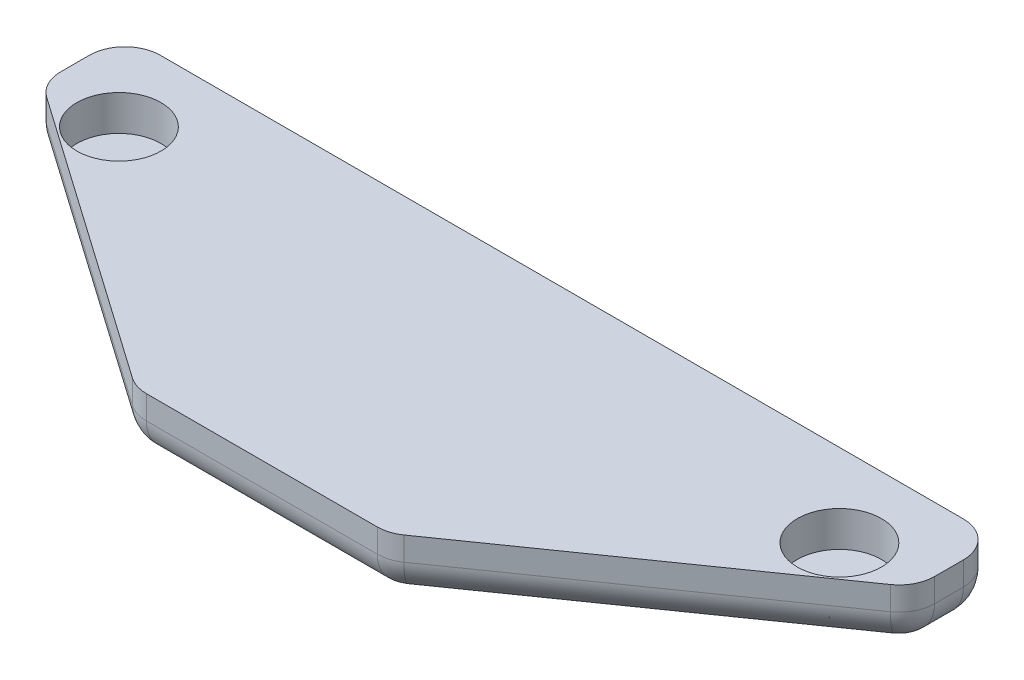
ISO-10303-21;
HEADER;
FILE_DESCRIPTION(('STEP AP214'),'2;1');
FILE_NAME('part.step','',(''),(''),'','','');
FILE_SCHEMA(('AUTOMOTIVE_DESIGN { 1 0 10303 214 1 1 1 1 }'));
ENDSEC;
DATA;
#1=APPLICATION_CONTEXT('core data for automotive mechanical design processes');
#2=APPLICATION_PROTOCOL_DEFINITION('international standard','automotive_design',2000,#1);
#3=PRODUCT_CONTEXT('',#1,'mechanical');
#4=PRODUCT('Part','Part','',(#3));
#5=PRODUCT_RELATED_PRODUCT_CATEGORY('part','',(#4));
#6=PRODUCT_DEFINITION_FORMATION('','',#4);
#7=PRODUCT_DEFINITION_CONTEXT('part definition',#1,'design');
#8=PRODUCT_DEFINITION('design','',#6,#7);
#9=PRODUCT_DEFINITION_SHAPE('','',#8);
#10=(LENGTH_UNIT() NAMED_UNIT(*) SI_UNIT(.MILLI.,.METRE.));
#11=(NAMED_UNIT(*) PLANE_ANGLE_UNIT() SI_UNIT($,.RADIAN.));
#12=(NAMED_UNIT(*) SI_UNIT($,.STERADIAN.) SOLID_ANGLE_UNIT());
#13=UNCERTAINTY_MEASURE_WITH_UNIT(LENGTH_MEASURE(1.E-05),#10,'distance_accuracy_value','');
#14=(GEOMETRIC_REPRESENTATION_CONTEXT(3) GLOBAL_UNCERTAINTY_ASSIGNED_CONTEXT((#13)) GLOBAL_UNIT_ASSIGNED_CONTEXT((#10,
#11,#12)) REPRESENTATION_CONTEXT('',''));
#15=CARTESIAN_POINT('',(0.,0.,0.));
#16=DIRECTION('',(0.,0.,1.));
#17=DIRECTION('',(1.,0.,0.));
#18=AXIS2_PLACEMENT_3D('',#15,#16,#17);
#19=CARTESIAN_POINT('',(-2.71615383625442,2.5,-11.7419034293701));
#20=DIRECTION('',(0.,0.,1.));
#21=DIRECTION('',(1.,0.,0.));
#22=AXIS2_PLACEMENT_3D('',#19,#20,#21);
#23=PLANE('',#22);
#24=DIRECTION('',(-1.,0.,0.));
#25=VECTOR('',#24,1.);
#26=CARTESIAN_POINT('',(-2.71615383625442,1.5,-11.7419034293701));
#27=LINE('',#26,#25);
#28=CARTESIAN_POINT('',(14.2838461637456,1.5,-11.7419034293701));
#29=VERTEX_POINT('',#28);
#30=CARTESIAN_POINT('',(-19.7161538362544,1.5,-11.7419034293701));
#31=VERTEX_POINT('',#30);
#32=EDGE_CURVE('E310',#29,#31,#27,.T.);
#33=ORIENTED_EDGE('',*,*,#32,.T.);
#34=DIRECTION('',(0.,-1.,0.));
#35=VECTOR('',#34,1.);
#36=CARTESIAN_POINT('',(-19.7161538362544,2.5,-11.7419034293701));
#37=LINE('',#36,#35);
#38=CARTESIAN_POINT('',(-19.7161538362544,2.5,-11.7419034293701));
#39=VERTEX_POINT('',#38);
#40=EDGE_CURVE('E313',#31,#39,#37,.F.);
#41=ORIENTED_EDGE('',*,*,#40,.T.);
#42=DIRECTION('',(-1.,0.,0.));
#43=VECTOR('',#42,1.);
#44=CARTESIAN_POINT('',(-2.71615383625442,2.5,-11.7419034293701));
#45=LINE('',#44,#43);
#46=CARTESIAN_POINT('',(14.2838461637456,2.5,-11.7419034293701));
#47=VERTEX_POINT('',#46);
#48=EDGE_CURVE('E265',#47,#39,#45,.T.);
#49=ORIENTED_EDGE('',*,*,#48,.F.);
#50=DIRECTION('',(0.,-1.,0.));
#51=VECTOR('',#50,1.);
#52=CARTESIAN_POINT('',(14.2838461637456,2.5,-11.7419034293701));
#53=LINE('',#52,#51);
#54=EDGE_CURVE('E214',#29,#47,#53,.F.);
#55=ORIENTED_EDGE('',*,*,#54,.F.);
#56=EDGE_LOOP('',(#33,#41,#49,#55));
#57=FACE_BOUND('',#56,.T.);
#58=ADVANCED_FACE('F44',(#57),#23,.F.);
#59=CARTESIAN_POINT('',(-21.2161538362544,2.5,-11.7419034293701));
#60=DIRECTION('',(1.,0.,0.));
#61=DIRECTION('',(0.,0.,-1.));
#62=AXIS2_PLACEMENT_3D('',#59,#60,#61);
#63=PLANE('',#62);
#64=DIRECTION('',(0.,0.,1.));
#65=VECTOR('',#64,1.);
#66=CARTESIAN_POINT('',(-21.2161538362544,1.5,-11.7419034293701));
#67=LINE('',#66,#65);
#68=CARTESIAN_POINT('',(-21.2161538362544,1.5,-10.2419034293701));
#69=VERTEX_POINT('',#68);
#70=CARTESIAN_POINT('',(-21.2161538362544,1.5,-9.02278939825636));
#71=VERTEX_POINT('',#70);
#72=EDGE_CURVE('E301',#69,#71,#67,.T.);
#73=ORIENTED_EDGE('',*,*,#72,.T.);
#74=DIRECTION('',(0.,-1.,0.));
#75=VECTOR('',#74,1.);
#76=CARTESIAN_POINT('',(-21.2161538362544,2.5,-9.02278939825636));
#77=LINE('',#76,#75);
#78=CARTESIAN_POINT('',(-21.2161538362544,2.5,-9.02278939825636));
#79=VERTEX_POINT('',#78);
#80=EDGE_CURVE('E307',#71,#79,#77,.F.);
#81=ORIENTED_EDGE('',*,*,#80,.T.);
#82=DIRECTION('',(0.,0.,1.));
#83=VECTOR('',#82,1.);
#84=CARTESIAN_POINT('',(-21.2161538362544,2.5,-11.7419034293701));
#85=LINE('',#84,#83);
#86=CARTESIAN_POINT('',(-21.2161538362544,2.5,-10.2419034293701));
#87=VERTEX_POINT('',#86);
#88=EDGE_CURVE('E273',#87,#79,#85,.T.);
#89=ORIENTED_EDGE('',*,*,#88,.F.);
#90=DIRECTION('',(0.,-1.,0.));
#91=VECTOR('',#90,1.);
#92=CARTESIAN_POINT('',(-21.2161538362544,2.5,-10.2419034293701));
#93=LINE('',#92,#91);
#94=EDGE_CURVE('E304',#87,#69,#93,.T.);
#95=ORIENTED_EDGE('',*,*,#94,.T.);
#96=EDGE_LOOP('',(#73,#81,#89,#95));
#97=FACE_BOUND('',#96,.T.);
#98=ADVANCED_FACE('F367',(#97),#63,.F.);
#99=CARTESIAN_POINT('',(-21.2161538362544,2.5,-8.24190342937014));
#100=DIRECTION('',(0.573546021853428,0.,-0.819173339908048));
#101=DIRECTION('',(-0.819173339908049,0.,-0.573546021853428));
#102=AXIS2_PLACEMENT_3D('',#99,#100,#101);
#103=PLANE('',#102);
#104=DIRECTION('',(0.819173339908049,0.,0.573546021853428));
#105=VECTOR('',#104,1.);
#106=CARTESIAN_POINT('',(-21.2161538362544,1.5,-8.24190342937014));
#107=LINE('',#106,#105);
#108=CARTESIAN_POINT('',(-20.5764728690346,1.5,-7.79402938839429));
#109=VERTEX_POINT('',#108);
#110=CARTESIAN_POINT('',(-8.46355530042968,1.5,0.686856580491928));
#111=VERTEX_POINT('',#110);
#112=EDGE_CURVE('E284',#109,#111,#107,.T.);
#113=ORIENTED_EDGE('',*,*,#112,.T.);
#114=DIRECTION('',(0.,-1.,0.));
#115=VECTOR('',#114,1.);
#116=CARTESIAN_POINT('',(-8.46355530042968,2.5,0.686856580491928));
#117=LINE('',#116,#115);
#118=CARTESIAN_POINT('',(-8.46355530042968,2.5,0.686856580491928));
#119=VERTEX_POINT('',#118);
#120=EDGE_CURVE('E290',#111,#119,#117,.F.);
#121=ORIENTED_EDGE('',*,*,#120,.T.);
#122=DIRECTION('',(0.819173339908048,0.,0.573546021853428));
#123=VECTOR('',#122,1.);
#124=CARTESIAN_POINT('',(-21.2161538362544,2.5,-8.24190342937014));
#125=LINE('',#124,#123);
#126=CARTESIAN_POINT('',(-20.5764728690346,2.5,-7.79402938839429));
#127=VERTEX_POINT('',#126);
#128=EDGE_CURVE('E164',#127,#119,#125,.T.);
#129=ORIENTED_EDGE('',*,*,#128,.F.);
#130=DIRECTION('',(0.,-1.,0.));
#131=VECTOR('',#130,1.);
#132=CARTESIAN_POINT('',(-20.5764728690346,2.5,-7.79402938839429));
#133=LINE('',#132,#131);
#134=EDGE_CURVE('E287',#127,#109,#133,.T.);
#135=ORIENTED_EDGE('',*,*,#134,.T.);
#136=EDGE_LOOP('',(#113,#121,#129,#135));
#137=FACE_BOUND('',#136,.T.);
#138=ADVANCED_FACE('F378',(#137),#103,.F.);
#139=CARTESIAN_POINT('',(-8.07615383625442,2.5,0.958096570629856));
#140=DIRECTION('',(0.,0.,-1.));
#141=DIRECTION('',(-1.,0.,0.));
#142=AXIS2_PLACEMENT_3D('',#139,#140,#141);
#143=PLANE('',#142);
#144=DIRECTION('',(1.,0.,0.));
#145=VECTOR('',#144,1.);
#146=CARTESIAN_POINT('',(-8.07615383625442,2.5,0.958096570629856));
#147=LINE('',#146,#145);
#148=CARTESIAN_POINT('',(-7.60323626764954,2.5,0.958096570629856));
#149=VERTEX_POINT('',#148);
#150=CARTESIAN_POINT('',(2.1709285951407,2.5,0.958096570629856));
#151=VERTEX_POINT('',#150);
#152=EDGE_CURVE('E148',#149,#151,#147,.T.);
#153=ORIENTED_EDGE('',*,*,#152,.F.);
#154=DIRECTION('',(0.,-1.,0.));
#155=VECTOR('',#154,1.);
#156=CARTESIAN_POINT('',(-7.60323626764954,2.5,0.958096570629856));
#157=LINE('',#156,#155);
#158=CARTESIAN_POINT('',(-7.60323626764954,1.5,0.958096570629856));
#159=VERTEX_POINT('',#158);
#160=EDGE_CURVE('E281',#149,#159,#157,.T.);
#161=ORIENTED_EDGE('',*,*,#160,.T.);
#162=DIRECTION('',(1.,0.,0.));
#163=VECTOR('',#162,1.);
#164=CARTESIAN_POINT('',(-8.07615383625442,1.5,0.958096570629856));
#165=LINE('',#164,#163);
#166=CARTESIAN_POINT('',(2.1709285951407,1.5,0.958096570629856));
#167=VERTEX_POINT('',#166);
#168=EDGE_CURVE('E163',#159,#167,#165,.T.);
#169=ORIENTED_EDGE('',*,*,#168,.T.);
#170=DIRECTION('',(0.,-1.,0.));
#171=VECTOR('',#170,1.);
#172=CARTESIAN_POINT('',(2.1709285951407,2.5,0.958096570629856));
#173=LINE('',#172,#171);
#174=EDGE_CURVE('E169',#151,#167,#173,.T.);
#175=ORIENTED_EDGE('',*,*,#174,.F.);
#176=EDGE_LOOP('',(#153,#161,#169,#175));
#177=FACE_BOUND('',#176,.T.);
#178=ADVANCED_FACE('F177',(#177),#143,.F.);
#179=CARTESIAN_POINT('',(0.,2.5,0.));
#180=DIRECTION('',(0.,1.,0.));
#181=DIRECTION('',(0.,0.,1.));
#182=AXIS2_PLACEMENT_3D('',#179,#180,#181);
#183=PLANE('',#182);
#184=CARTESIAN_POINT('',(-17.9661538362544,2.5,-8.24190342937015));
#185=DIRECTION('',(0.,1.,0.));
#186=DIRECTION('',(0.,0.,1.));
#187=AXIS2_PLACEMENT_3D('',#184,#185,#186);
#188=CIRCLE('',#187,1.78);
#189=CARTESIAN_POINT('',(-17.9661538362544,2.5,-6.46190342937015));
#190=VERTEX_POINT('',#189);
#191=EDGE_CURVE('E266',#190,#190,#188,.T.);
#192=ORIENTED_EDGE('',*,*,#191,.F.);
#193=EDGE_LOOP('',(#192));
#194=FACE_BOUND('',#193,.T.);
#195=ORIENTED_EDGE('',*,*,#128,.T.);
#196=CARTESIAN_POINT('',(-7.60323626764954,2.5,-0.541903429370144));
#197=DIRECTION('',(0.,1.,0.));
#198=DIRECTION('',(0.,0.,1.));
#199=AXIS2_PLACEMENT_3D('',#196,#197,#198);
#200=CIRCLE('',#199,1.5);
#201=EDGE_CURVE('E157',#119,#149,#200,.T.);
#202=ORIENTED_EDGE('',*,*,#201,.T.);
#203=ORIENTED_EDGE('',*,*,#152,.T.);
#204=CARTESIAN_POINT('',(2.1709285951407,2.5,-0.541903429370144));
#205=DIRECTION('',(0.,-1.,0.));
#206=DIRECTION('',(0.,0.,1.));
#207=AXIS2_PLACEMENT_3D('',#204,#205,#206);
#208=CIRCLE('',#207,1.5);
#209=CARTESIAN_POINT('',(3.03124762792084,2.5,0.686856580491928));
#210=VERTEX_POINT('',#209);
#211=EDGE_CURVE('E154',#210,#151,#208,.T.);
#212=ORIENTED_EDGE('',*,*,#211,.F.);
#213=DIRECTION('',(-0.819173339908048,0.,0.573546021853428));
#214=VECTOR('',#213,1.);
#215=CARTESIAN_POINT('',(15.7838461637456,2.5,-8.24190342937014));
#216=LINE('',#215,#214);
#217=CARTESIAN_POINT('',(15.1441651965257,2.5,-7.79402938839429));
#218=VERTEX_POINT('',#217);
#219=EDGE_CURVE('E182',#218,#210,#216,.T.);
#220=ORIENTED_EDGE('',*,*,#219,.F.);
#221=CARTESIAN_POINT('',(14.2838461637456,2.5,-9.02278939825636));
#222=DIRECTION('',(0.,-1.,0.));
#223=DIRECTION('',(0.,0.,1.));
#224=AXIS2_PLACEMENT_3D('',#221,#222,#223);
#225=CIRCLE('',#224,1.5);
#226=CARTESIAN_POINT('',(15.7838461637456,2.5,-9.02278939825636));
#227=VERTEX_POINT('',#226);
#228=EDGE_CURVE('E175',#227,#218,#225,.T.);
#229=ORIENTED_EDGE('',*,*,#228,.F.);
#230=DIRECTION('',(0.,0.,1.));
#231=VECTOR('',#230,1.);
#232=CARTESIAN_POINT('',(15.7838461637456,2.5,-11.7419034293701));
#233=LINE('',#232,#231);
#234=CARTESIAN_POINT('',(15.7838461637456,2.5,-10.2419034293701));
#235=VERTEX_POINT('',#234);
#236=EDGE_CURVE('E189',#235,#227,#233,.T.);
#237=ORIENTED_EDGE('',*,*,#236,.F.);
#238=CARTESIAN_POINT('',(14.2838461637456,2.5,-10.2419034293701));
#239=DIRECTION('',(0.,-1.,0.));
#240=DIRECTION('',(0.,0.,1.));
#241=AXIS2_PLACEMENT_3D('',#238,#239,#240);
#242=CIRCLE('',#241,1.5);
#243=EDGE_CURVE('E198',#47,#235,#242,.T.);
#244=ORIENTED_EDGE('',*,*,#243,.F.);
#245=ORIENTED_EDGE('',*,*,#48,.T.);
#246=CARTESIAN_POINT('',(-19.7161538362544,2.5,-10.2419034293701));
#247=DIRECTION('',(0.,1.,0.));
#248=DIRECTION('',(0.,0.,1.));
#249=AXIS2_PLACEMENT_3D('',#246,#247,#248);
#250=CIRCLE('',#249,1.5);
#251=EDGE_CURVE('E293',#39,#87,#250,.T.);
#252=ORIENTED_EDGE('',*,*,#251,.T.);
#253=ORIENTED_EDGE('',*,*,#88,.T.);
#254=CARTESIAN_POINT('',(-19.7161538362544,2.5,-9.02278939825636));
#255=DIRECTION('',(0.,1.,0.));
#256=DIRECTION('',(0.,0.,1.));
#257=AXIS2_PLACEMENT_3D('',#254,#255,#256);
#258=CIRCLE('',#257,1.5);
#259=EDGE_CURVE('E296',#79,#127,#258,.T.);
#260=ORIENTED_EDGE('',*,*,#259,.T.);
#261=EDGE_LOOP('',(#195,#202,#203,#212,#220,#229,#237,#244,#245,#252,#253,#260));
#262=FACE_BOUND('',#261,.T.);
#263=CARTESIAN_POINT('',(12.5338461637456,2.5,-8.24190342937015));
#264=DIRECTION('',(0.,-1.,0.));
#265=DIRECTION('',(0.,0.,1.));
#266=AXIS2_PLACEMENT_3D('',#263,#264,#265);
#267=CIRCLE('',#266,1.78);
#268=CARTESIAN_POINT('',(12.5338461637456,2.5,-6.46190342937015));
#269=VERTEX_POINT('',#268);
#270=EDGE_CURVE('E260',#269,#269,#267,.T.);
#271=ORIENTED_EDGE('',*,*,#270,.T.);
#272=EDGE_LOOP('',(#271));
#273=FACE_BOUND('',#272,.T.);
#274=ADVANCED_FACE('F151',(#194,#262,#273),#183,.T.);
#275=CARTESIAN_POINT('',(0.,0.,0.));
#276=DIRECTION('',(0.,1.,0.));
#277=DIRECTION('',(0.,0.,1.));
#278=AXIS2_PLACEMENT_3D('',#275,#276,#277);
#279=PLANE('',#278);
#280=DIRECTION('',(-1.,0.,0.));
#281=VECTOR('',#280,1.);
#282=CARTESIAN_POINT('',(0.,0.,-10.2419034293701));
#283=LINE('',#282,#281);
#284=CARTESIAN_POINT('',(-19.7161538362544,0.,-10.2419034293701));
#285=VERTEX_POINT('',#284);
#286=CARTESIAN_POINT('',(14.2838461637456,0.,-10.2419034293701));
#287=VERTEX_POINT('',#286);
#288=EDGE_CURVE('E316',#285,#287,#283,.F.);
#289=ORIENTED_EDGE('',*,*,#288,.T.);
#290=DIRECTION('',(0.,0.,1.));
#291=VECTOR('',#290,1.);
#292=CARTESIAN_POINT('',(14.2838461637456,0.,0.));
#293=LINE('',#292,#291);
#294=CARTESIAN_POINT('',(14.2838461637456,0.,-9.02278939825636));
#295=VERTEX_POINT('',#294);
#296=EDGE_CURVE('E218',#295,#287,#293,.F.);
#297=ORIENTED_EDGE('',*,*,#296,.F.);
#298=DIRECTION('',(-0.819173339908049,0.,0.573546021853428));
#299=VECTOR('',#298,1.);
#300=CARTESIAN_POINT('',(-3.18578923282157,0.,3.20861438016204));
#301=LINE('',#300,#299);
#302=CARTESIAN_POINT('',(2.1709285951407,0.,-0.541903429370144));
#303=VERTEX_POINT('',#302);
#304=EDGE_CURVE('E222',#303,#295,#301,.F.);
#305=ORIENTED_EDGE('',*,*,#304,.F.);
#306=DIRECTION('',(1.,0.,0.));
#307=VECTOR('',#306,1.);
#308=CARTESIAN_POINT('',(0.,0.,-0.541903429370144));
#309=LINE('',#308,#307);
#310=CARTESIAN_POINT('',(-7.60323626764954,0.,-0.541903429370144));
#311=VERTEX_POINT('',#310);
#312=EDGE_CURVE('E11',#303,#311,#309,.F.);
#313=ORIENTED_EDGE('',*,*,#312,.T.);
#314=DIRECTION('',(0.819173339908049,0.,0.573546021853428));
#315=VECTOR('',#314,1.);
#316=CARTESIAN_POINT('',(-2.24651843968727,0.,3.20861438016204));
#317=LINE('',#316,#315);
#318=CARTESIAN_POINT('',(-19.7161538362544,0.,-9.02278939825636));
#319=VERTEX_POINT('',#318);
#320=EDGE_CURVE('E54',#311,#319,#317,.F.);
#321=ORIENTED_EDGE('',*,*,#320,.T.);
#322=DIRECTION('',(0.,0.,1.));
#323=VECTOR('',#322,1.);
#324=CARTESIAN_POINT('',(-19.7161538362544,0.,0.));
#325=LINE('',#324,#323);
#326=EDGE_CURVE('E319',#319,#285,#325,.F.);
#327=ORIENTED_EDGE('',*,*,#326,.T.);
#328=EDGE_LOOP('',(#289,#297,#305,#313,#321,#327));
#329=FACE_BOUND('',#328,.T.);
#330=ADVANCED_FACE('F395',(#329),#279,.F.);
#331=CARTESIAN_POINT('',(-17.9661538362544,1.,-8.24190342937015));
#332=DIRECTION('',(0.,1.,0.));
#333=DIRECTION('',(0.,0.,1.));
#334=AXIS2_PLACEMENT_3D('',#331,#332,#333);
#335=CYLINDRICAL_SURFACE('',#334,1.78);
#336=CARTESIAN_POINT('',(-17.9661538362544,1.,-8.24190342937015));
#337=DIRECTION('',(0.,1.,0.));
#338=DIRECTION('',(0.,0.,1.));
#339=AXIS2_PLACEMENT_3D('',#336,#337,#338);
#340=CIRCLE('',#339,1.78);
#341=CARTESIAN_POINT('',(-17.9661538362544,1.,-6.46190342937015));
#342=VERTEX_POINT('',#341);
#343=EDGE_CURVE('E261',#342,#342,#340,.T.);
#344=ORIENTED_EDGE('',*,*,#343,.F.);
#345=EDGE_LOOP('',(#344));
#346=FACE_BOUND('',#345,.T.);
#347=ORIENTED_EDGE('',*,*,#191,.T.);
#348=EDGE_LOOP('',(#347));
#349=FACE_BOUND('',#348,.T.);
#350=ADVANCED_FACE('F502',(#346,#349),#335,.F.);
#351=CARTESIAN_POINT('',(-17.9661538362544,1.,-8.24190342937015));
#352=DIRECTION('',(0.,1.,0.));
#353=DIRECTION('',(0.,0.,1.));
#354=AXIS2_PLACEMENT_3D('',#351,#352,#353);
#355=PLANE('',#354);
#356=ORIENTED_EDGE('',*,*,#343,.T.);
#357=EDGE_LOOP('',(#356));
#358=FACE_BOUND('',#357,.T.);
#359=ADVANCED_FACE('F471',(#358),#355,.T.);
#360=CARTESIAN_POINT('',(-2.71615383625442,1.5,-10.2419034293701));
#361=DIRECTION('',(-1.,0.,0.));
#362=DIRECTION('',(0.,0.,1.));
#363=AXIS2_PLACEMENT_3D('',#360,#361,#362);
#364=CYLINDRICAL_SURFACE('',#363,1.5);
#365=ORIENTED_EDGE('',*,*,#32,.F.);
#366=CARTESIAN_POINT('',(14.2838461637456,1.5,-10.2419034293701));
#367=DIRECTION('',(-1.,0.,0.));
#368=DIRECTION('',(0.,0.,1.));
#369=AXIS2_PLACEMENT_3D('',#366,#367,#368);
#370=CIRCLE('',#369,1.5);
#371=EDGE_CURVE('E256',#29,#287,#370,.T.);
#372=ORIENTED_EDGE('',*,*,#371,.T.);
#373=ORIENTED_EDGE('',*,*,#288,.F.);
#374=CARTESIAN_POINT('',(-19.7161538362544,1.5,-10.2419034293701));
#375=DIRECTION('',(-1.,0.,0.));
#376=DIRECTION('',(0.,0.,1.));
#377=AXIS2_PLACEMENT_3D('',#374,#375,#376);
#378=CIRCLE('',#377,1.5);
#379=EDGE_CURVE('E48',#31,#285,#378,.T.);
#380=ORIENTED_EDGE('',*,*,#379,.F.);
#381=EDGE_LOOP('',(#365,#372,#373,#380));
#382=FACE_BOUND('',#381,.T.);
#383=ADVANCED_FACE('F46',(#382),#364,.T.);
#384=CARTESIAN_POINT('',(-19.7161538362544,2.5,-10.2419034293701));
#385=DIRECTION('',(0.,-1.,0.));
#386=DIRECTION('',(0.,0.,-1.));
#387=AXIS2_PLACEMENT_3D('',#384,#385,#386);
#388=CYLINDRICAL_SURFACE('',#387,1.5);
#389=ORIENTED_EDGE('',*,*,#251,.F.);
#390=ORIENTED_EDGE('',*,*,#40,.F.);
#391=CARTESIAN_POINT('',(-19.7161538362544,1.5,-10.2419034293701));
#392=DIRECTION('',(0.,-1.,0.));
#393=DIRECTION('',(0.,0.,-1.));
#394=AXIS2_PLACEMENT_3D('',#391,#392,#393);
#395=CIRCLE('',#394,1.5);
#396=EDGE_CURVE('E349',#69,#31,#395,.T.);
#397=ORIENTED_EDGE('',*,*,#396,.F.);
#398=ORIENTED_EDGE('',*,*,#94,.F.);
#399=EDGE_LOOP('',(#389,#390,#397,#398));
#400=FACE_BOUND('',#399,.T.);
#401=ADVANCED_FACE('F465',(#400),#388,.T.);
#402=CARTESIAN_POINT('',(-19.7161538362544,1.5,-10.2419034293701));
#403=DIRECTION('',(0.,0.,-1.));
#404=DIRECTION('',(-1.,0.,0.));
#405=AXIS2_PLACEMENT_3D('',#402,#403,#404);
#406=SPHERICAL_SURFACE('',#405,1.5);
#407=ORIENTED_EDGE('',*,*,#396,.T.);
#408=ORIENTED_EDGE('',*,*,#379,.T.);
#409=CARTESIAN_POINT('',(-19.7161538362544,1.5,-10.2419034293701));
#410=DIRECTION('',(0.,0.,-1.));
#411=DIRECTION('',(-1.,0.,0.));
#412=AXIS2_PLACEMENT_3D('',#409,#410,#411);
#413=CIRCLE('',#412,1.5);
#414=EDGE_CURVE('E346',#69,#285,#413,.F.);
#415=ORIENTED_EDGE('',*,*,#414,.F.);
#416=EDGE_LOOP('',(#407,#408,#415));
#417=FACE_BOUND('',#416,.T.);
#418=ADVANCED_FACE('F358',(#417),#406,.T.);
#419=CARTESIAN_POINT('',(-19.7161538362544,1.5,-11.7419034293701));
#420=DIRECTION('',(0.,0.,1.));
#421=DIRECTION('',(1.,0.,0.));
#422=AXIS2_PLACEMENT_3D('',#419,#420,#421);
#423=CYLINDRICAL_SURFACE('',#422,1.5);
#424=ORIENTED_EDGE('',*,*,#414,.T.);
#425=ORIENTED_EDGE('',*,*,#326,.F.);
#426=CARTESIAN_POINT('',(-19.7161538362544,1.5,-9.02278939825636));
#427=DIRECTION('',(0.,0.,1.));
#428=DIRECTION('',(1.,0.,0.));
#429=AXIS2_PLACEMENT_3D('',#426,#427,#428);
#430=CIRCLE('',#429,1.5);
#431=EDGE_CURVE('E342',#71,#319,#430,.T.);
#432=ORIENTED_EDGE('',*,*,#431,.F.);
#433=ORIENTED_EDGE('',*,*,#72,.F.);
#434=EDGE_LOOP('',(#424,#425,#432,#433));
#435=FACE_BOUND('',#434,.T.);
#436=ADVANCED_FACE('F363',(#435),#423,.T.);
#437=CARTESIAN_POINT('',(-19.7161538362544,2.5,-9.02278939825636));
#438=DIRECTION('',(0.,-1.,0.));
#439=DIRECTION('',(0.,0.,-1.));
#440=AXIS2_PLACEMENT_3D('',#437,#438,#439);
#441=CYLINDRICAL_SURFACE('',#440,1.5);
#442=ORIENTED_EDGE('',*,*,#259,.F.);
#443=ORIENTED_EDGE('',*,*,#80,.F.);
#444=CARTESIAN_POINT('',(-19.7161538362544,1.5,-9.02278939825636));
#445=DIRECTION('',(0.,-1.,0.));
#446=DIRECTION('',(0.,0.,-1.));
#447=AXIS2_PLACEMENT_3D('',#444,#445,#446);
#448=CIRCLE('',#447,1.5);
#449=EDGE_CURVE('E338',#109,#71,#448,.T.);
#450=ORIENTED_EDGE('',*,*,#449,.F.);
#451=ORIENTED_EDGE('',*,*,#134,.F.);
#452=EDGE_LOOP('',(#442,#443,#450,#451));
#453=FACE_BOUND('',#452,.T.);
#454=ADVANCED_FACE('F373',(#453),#441,.T.);
#455=CARTESIAN_POINT('',(-19.7161538362544,1.5,-9.02278939825636));
#456=DIRECTION('',(0.,-1.,0.));
#457=DIRECTION('',(0.,0.,-1.));
#458=AXIS2_PLACEMENT_3D('',#455,#456,#457);
#459=SPHERICAL_SURFACE('',#458,1.5);
#460=ORIENTED_EDGE('',*,*,#449,.T.);
#461=ORIENTED_EDGE('',*,*,#431,.T.);
#462=CARTESIAN_POINT('',(-19.7161538362544,1.5,-9.02278939825636));
#463=DIRECTION('',(-0.819173339908048,0.,-0.573546021853428));
#464=DIRECTION('',(-0.573546021853428,0.,0.819173339908048));
#465=AXIS2_PLACEMENT_3D('',#462,#463,#464);
#466=CIRCLE('',#465,1.5);
#467=EDGE_CURVE('E334',#109,#319,#466,.F.);
#468=ORIENTED_EDGE('',*,*,#467,.F.);
#469=EDGE_LOOP('',(#460,#461,#468));
#470=FACE_BOUND('',#469,.T.);
#471=ADVANCED_FACE('F456',(#470),#459,.T.);
#472=CARTESIAN_POINT('',(-8.07615383625442,1.5,-0.541903429370144));
#473=DIRECTION('',(1.,0.,0.));
#474=DIRECTION('',(0.,0.,-1.));
#475=AXIS2_PLACEMENT_3D('',#472,#473,#474);
#476=CYLINDRICAL_SURFACE('',#475,1.5);
#477=ORIENTED_EDGE('',*,*,#312,.F.);
#478=CARTESIAN_POINT('',(2.1709285951407,1.5,-0.541903429370144));
#479=DIRECTION('',(-1.,0.,0.));
#480=DIRECTION('',(0.,0.,1.));
#481=AXIS2_PLACEMENT_3D('',#478,#479,#480);
#482=CIRCLE('',#481,1.5);
#483=EDGE_CURVE('E234',#303,#167,#482,.T.);
#484=ORIENTED_EDGE('',*,*,#483,.T.);
#485=ORIENTED_EDGE('',*,*,#168,.F.);
#486=CARTESIAN_POINT('',(-7.60323626764954,1.5,-0.541903429370144));
#487=DIRECTION('',(-1.,0.,0.));
#488=DIRECTION('',(0.,0.,1.));
#489=AXIS2_PLACEMENT_3D('',#486,#487,#488);
#490=CIRCLE('',#489,1.5);
#491=EDGE_CURVE('E330',#311,#159,#490,.T.);
#492=ORIENTED_EDGE('',*,*,#491,.F.);
#493=EDGE_LOOP('',(#477,#484,#485,#492));
#494=FACE_BOUND('',#493,.T.);
#495=ADVANCED_FACE('F389',(#494),#476,.T.);
#496=CARTESIAN_POINT('',(-20.3558348034743,1.5,-9.47066343923222));
#497=DIRECTION('',(0.819173339908049,0.,0.573546021853428));
#498=DIRECTION('',(0.573546021853428,0.,-0.819173339908048));
#499=AXIS2_PLACEMENT_3D('',#496,#497,#498);
#500=CYLINDRICAL_SURFACE('',#499,1.5);
#501=ORIENTED_EDGE('',*,*,#467,.T.);
#502=ORIENTED_EDGE('',*,*,#320,.F.);
#503=CARTESIAN_POINT('',(-7.60323626764954,1.5,-0.541903429370145));
#504=DIRECTION('',(0.819173339908048,0.,0.573546021853428));
#505=DIRECTION('',(0.573546021853428,0.,-0.819173339908049));
#506=AXIS2_PLACEMENT_3D('',#503,#504,#505);
#507=CIRCLE('',#506,1.5);
#508=EDGE_CURVE('E326',#111,#311,#507,.T.);
#509=ORIENTED_EDGE('',*,*,#508,.F.);
#510=ORIENTED_EDGE('',*,*,#112,.F.);
#511=EDGE_LOOP('',(#501,#502,#509,#510));
#512=FACE_BOUND('',#511,.T.);
#513=ADVANCED_FACE('F450',(#512),#500,.T.);
#514=CARTESIAN_POINT('',(-7.60323626764954,1.5,-0.541903429370144));
#515=DIRECTION('',(0.,-1.,0.));
#516=DIRECTION('',(1.,0.,0.));
#517=AXIS2_PLACEMENT_3D('',#514,#515,#516);
#518=SPHERICAL_SURFACE('',#517,1.5);
#519=ORIENTED_EDGE('',*,*,#508,.T.);
#520=ORIENTED_EDGE('',*,*,#491,.T.);
#521=CARTESIAN_POINT('',(-7.60323626764954,1.5,-0.541903429370144));
#522=DIRECTION('',(0.,-1.,0.));
#523=DIRECTION('',(0.,0.,-1.));
#524=AXIS2_PLACEMENT_3D('',#521,#522,#523);
#525=CIRCLE('',#524,1.5);
#526=EDGE_CURVE('E226',#111,#159,#525,.F.);
#527=ORIENTED_EDGE('',*,*,#526,.F.);
#528=EDGE_LOOP('',(#519,#520,#527));
#529=FACE_BOUND('',#528,.T.);
#530=ADVANCED_FACE('F386',(#529),#518,.T.);
#531=CARTESIAN_POINT('',(-7.60323626764954,2.5,-0.541903429370144));
#532=DIRECTION('',(0.,-1.,0.));
#533=DIRECTION('',(0.,0.,-1.));
#534=AXIS2_PLACEMENT_3D('',#531,#532,#533);
#535=CYLINDRICAL_SURFACE('',#534,1.5);
#536=ORIENTED_EDGE('',*,*,#201,.F.);
#537=ORIENTED_EDGE('',*,*,#120,.F.);
#538=ORIENTED_EDGE('',*,*,#526,.T.);
#539=ORIENTED_EDGE('',*,*,#160,.F.);
#540=EDGE_LOOP('',(#536,#537,#538,#539));
#541=FACE_BOUND('',#540,.T.);
#542=ADVANCED_FACE('F384',(#541),#535,.T.);
#543=CARTESIAN_POINT('',(15.7838461637456,2.5,-11.7419034293701));
#544=DIRECTION('',(-1.,0.,0.));
#545=DIRECTION('',(0.,0.,-1.));
#546=AXIS2_PLACEMENT_3D('',#543,#544,#545);
#547=PLANE('',#546);
#548=DIRECTION('',(0.,0.,1.));
#549=VECTOR('',#548,1.);
#550=CARTESIAN_POINT('',(15.7838461637456,1.5,-11.7419034293701));
#551=LINE('',#550,#549);
#552=CARTESIAN_POINT('',(15.7838461637456,1.5,-10.2419034293701));
#553=VERTEX_POINT('',#552);
#554=CARTESIAN_POINT('',(15.7838461637456,1.5,-9.02278939825636));
#555=VERTEX_POINT('',#554);
#556=EDGE_CURVE('E174',#553,#555,#551,.T.);
#557=ORIENTED_EDGE('',*,*,#556,.F.);
#558=DIRECTION('',(0.,-1.,0.));
#559=VECTOR('',#558,1.);
#560=CARTESIAN_POINT('',(15.7838461637456,2.5,-10.2419034293701));
#561=LINE('',#560,#559);
#562=EDGE_CURVE('E206',#235,#553,#561,.T.);
#563=ORIENTED_EDGE('',*,*,#562,.F.);
#564=ORIENTED_EDGE('',*,*,#236,.T.);
#565=DIRECTION('',(0.,-1.,0.));
#566=VECTOR('',#565,1.);
#567=CARTESIAN_POINT('',(15.7838461637456,2.5,-9.02278939825636));
#568=LINE('',#567,#566);
#569=EDGE_CURVE('E210',#555,#227,#568,.F.);
#570=ORIENTED_EDGE('',*,*,#569,.F.);
#571=EDGE_LOOP('',(#557,#563,#564,#570));
#572=FACE_BOUND('',#571,.T.);
#573=ADVANCED_FACE('F413',(#572),#547,.F.);
#574=CARTESIAN_POINT('',(15.7838461637456,2.5,-8.24190342937014));
#575=DIRECTION('',(-0.573546021853428,0.,-0.819173339908048));
#576=DIRECTION('',(0.819173339908049,0.,-0.573546021853428));
#577=AXIS2_PLACEMENT_3D('',#574,#575,#576);
#578=PLANE('',#577);
#579=DIRECTION('',(-0.819173339908049,0.,0.573546021853428));
#580=VECTOR('',#579,1.);
#581=CARTESIAN_POINT('',(15.7838461637456,1.5,-8.24190342937014));
#582=LINE('',#581,#580);
#583=CARTESIAN_POINT('',(15.1441651965257,1.5,-7.79402938839429));
#584=VERTEX_POINT('',#583);
#585=CARTESIAN_POINT('',(3.03124762792084,1.5,0.686856580491928));
#586=VERTEX_POINT('',#585);
#587=EDGE_CURVE('E181',#584,#586,#582,.T.);
#588=ORIENTED_EDGE('',*,*,#587,.F.);
#589=DIRECTION('',(0.,-1.,0.));
#590=VECTOR('',#589,1.);
#591=CARTESIAN_POINT('',(15.1441651965257,2.5,-7.79402938839429));
#592=LINE('',#591,#590);
#593=EDGE_CURVE('E187',#218,#584,#592,.T.);
#594=ORIENTED_EDGE('',*,*,#593,.F.);
#595=ORIENTED_EDGE('',*,*,#219,.T.);
#596=DIRECTION('',(0.,-1.,0.));
#597=VECTOR('',#596,1.);
#598=CARTESIAN_POINT('',(3.03124762792084,2.5,0.686856580491928));
#599=LINE('',#598,#597);
#600=EDGE_CURVE('E171',#586,#210,#599,.F.);
#601=ORIENTED_EDGE('',*,*,#600,.F.);
#602=EDGE_LOOP('',(#588,#594,#595,#601));
#603=FACE_BOUND('',#602,.T.);
#604=ADVANCED_FACE('F402',(#603),#578,.F.);
#605=CARTESIAN_POINT('',(12.5338461637456,1.,-8.24190342937015));
#606=DIRECTION('',(0.,1.,0.));
#607=DIRECTION('',(0.,0.,1.));
#608=AXIS2_PLACEMENT_3D('',#605,#606,#607);
#609=CYLINDRICAL_SURFACE('',#608,1.78);
#610=CARTESIAN_POINT('',(12.5338461637456,1.,-8.24190342937015));
#611=DIRECTION('',(0.,-1.,0.));
#612=DIRECTION('',(0.,0.,1.));
#613=AXIS2_PLACEMENT_3D('',#610,#611,#612);
#614=CIRCLE('',#613,1.78);
#615=CARTESIAN_POINT('',(12.5338461637456,1.,-6.46190342937015));
#616=VERTEX_POINT('',#615);
#617=EDGE_CURVE('E415',#616,#616,#614,.T.);
#618=ORIENTED_EDGE('',*,*,#617,.T.);
#619=EDGE_LOOP('',(#618));
#620=FACE_BOUND('',#619,.T.);
#621=ORIENTED_EDGE('',*,*,#270,.F.);
#622=EDGE_LOOP('',(#621));
#623=FACE_BOUND('',#622,.T.);
#624=ADVANCED_FACE('F424',(#620,#623),#609,.F.);
#625=CARTESIAN_POINT('',(12.5338461637456,1.,-8.24190342937015));
#626=DIRECTION('',(0.,1.,0.));
#627=DIRECTION('',(0.,0.,1.));
#628=AXIS2_PLACEMENT_3D('',#625,#626,#627);
#629=PLANE('',#628);
#630=ORIENTED_EDGE('',*,*,#617,.F.);
#631=EDGE_LOOP('',(#630));
#632=FACE_BOUND('',#631,.T.);
#633=ADVANCED_FACE('F426',(#632),#629,.T.);
#634=CARTESIAN_POINT('',(14.2838461637456,2.5,-10.2419034293701));
#635=DIRECTION('',(0.,-1.,0.));
#636=DIRECTION('',(0.,0.,-1.));
#637=AXIS2_PLACEMENT_3D('',#634,#635,#636);
#638=CYLINDRICAL_SURFACE('',#637,1.5);
#639=ORIENTED_EDGE('',*,*,#243,.T.);
#640=ORIENTED_EDGE('',*,*,#562,.T.);
#641=CARTESIAN_POINT('',(14.2838461637456,1.5,-10.2419034293701));
#642=DIRECTION('',(0.,1.,0.));
#643=DIRECTION('',(0.,0.,-1.));
#644=AXIS2_PLACEMENT_3D('',#641,#642,#643);
#645=CIRCLE('',#644,1.5);
#646=EDGE_CURVE('E252',#553,#29,#645,.T.);
#647=ORIENTED_EDGE('',*,*,#646,.T.);
#648=ORIENTED_EDGE('',*,*,#54,.T.);
#649=EDGE_LOOP('',(#639,#640,#647,#648));
#650=FACE_BOUND('',#649,.T.);
#651=ADVANCED_FACE('F433',(#650),#638,.T.);
#652=CARTESIAN_POINT('',(14.2838461637456,1.5,-10.2419034293701));
#653=DIRECTION('',(0.,0.,-1.));
#654=DIRECTION('',(1.,0.,0.));
#655=AXIS2_PLACEMENT_3D('',#652,#653,#654);
#656=SPHERICAL_SURFACE('',#655,1.5);
#657=ORIENTED_EDGE('',*,*,#646,.F.);
#658=CARTESIAN_POINT('',(14.2838461637456,1.5,-10.2419034293701));
#659=DIRECTION('',(0.,0.,1.));
#660=DIRECTION('',(1.,0.,0.));
#661=AXIS2_PLACEMENT_3D('',#658,#659,#660);
#662=CIRCLE('',#661,1.5);
#663=EDGE_CURVE('E248',#553,#287,#662,.F.);
#664=ORIENTED_EDGE('',*,*,#663,.T.);
#665=ORIENTED_EDGE('',*,*,#371,.F.);
#666=EDGE_LOOP('',(#657,#664,#665));
#667=FACE_BOUND('',#666,.T.);
#668=ADVANCED_FACE('F479',(#667),#656,.T.);
#669=CARTESIAN_POINT('',(14.2838461637456,1.5,-11.7419034293701));
#670=DIRECTION('',(0.,0.,1.));
#671=DIRECTION('',(-1.,0.,0.));
#672=AXIS2_PLACEMENT_3D('',#669,#670,#671);
#673=CYLINDRICAL_SURFACE('',#672,1.5);
#674=ORIENTED_EDGE('',*,*,#663,.F.);
#675=ORIENTED_EDGE('',*,*,#556,.T.);
#676=CARTESIAN_POINT('',(14.2838461637456,1.5,-9.02278939825636));
#677=DIRECTION('',(0.,0.,-1.));
#678=DIRECTION('',(-1.,0.,0.));
#679=AXIS2_PLACEMENT_3D('',#676,#677,#678);
#680=CIRCLE('',#679,1.5);
#681=EDGE_CURVE('E244',#555,#295,#680,.T.);
#682=ORIENTED_EDGE('',*,*,#681,.T.);
#683=ORIENTED_EDGE('',*,*,#296,.T.);
#684=EDGE_LOOP('',(#674,#675,#682,#683));
#685=FACE_BOUND('',#684,.T.);
#686=ADVANCED_FACE('F481',(#685),#673,.T.);
#687=CARTESIAN_POINT('',(14.2838461637456,2.5,-9.02278939825636));
#688=DIRECTION('',(0.,-1.,0.));
#689=DIRECTION('',(0.,0.,-1.));
#690=AXIS2_PLACEMENT_3D('',#687,#688,#689);
#691=CYLINDRICAL_SURFACE('',#690,1.5);
#692=ORIENTED_EDGE('',*,*,#228,.T.);
#693=ORIENTED_EDGE('',*,*,#593,.T.);
#694=CARTESIAN_POINT('',(14.2838461637456,1.5,-9.02278939825636));
#695=DIRECTION('',(0.,1.,0.));
#696=DIRECTION('',(0.,0.,-1.));
#697=AXIS2_PLACEMENT_3D('',#694,#695,#696);
#698=CIRCLE('',#697,1.5);
#699=EDGE_CURVE('E241',#584,#555,#698,.T.);
#700=ORIENTED_EDGE('',*,*,#699,.T.);
#701=ORIENTED_EDGE('',*,*,#569,.T.);
#702=EDGE_LOOP('',(#692,#693,#700,#701));
#703=FACE_BOUND('',#702,.T.);
#704=ADVANCED_FACE('F409',(#703),#691,.T.);
#705=CARTESIAN_POINT('',(14.2838461637456,1.5,-9.02278939825636));
#706=DIRECTION('',(0.,-1.,0.));
#707=DIRECTION('',(0.,0.,-1.));
#708=AXIS2_PLACEMENT_3D('',#705,#706,#707);
#709=SPHERICAL_SURFACE('',#708,1.5);
#710=ORIENTED_EDGE('',*,*,#699,.F.);
#711=CARTESIAN_POINT('',(14.2838461637456,1.5,-9.02278939825636));
#712=DIRECTION('',(-0.819173339908048,0.,0.573546021853428));
#713=DIRECTION('',(0.573546021853428,0.,0.819173339908048));
#714=AXIS2_PLACEMENT_3D('',#711,#712,#713);
#715=CIRCLE('',#714,1.5);
#716=EDGE_CURVE('E238',#584,#295,#715,.F.);
#717=ORIENTED_EDGE('',*,*,#716,.T.);
#718=ORIENTED_EDGE('',*,*,#681,.F.);
#719=EDGE_LOOP('',(#710,#717,#718));
#720=FACE_BOUND('',#719,.T.);
#721=ADVANCED_FACE('F483',(#720),#709,.T.);
#722=CARTESIAN_POINT('',(14.9235271309654,1.5,-9.47066343923222));
#723=DIRECTION('',(-0.819173339908049,0.,0.573546021853428));
#724=DIRECTION('',(-0.573546021853428,0.,-0.819173339908048));
#725=AXIS2_PLACEMENT_3D('',#722,#723,#724);
#726=CYLINDRICAL_SURFACE('',#725,1.5);
#727=ORIENTED_EDGE('',*,*,#716,.F.);
#728=ORIENTED_EDGE('',*,*,#587,.T.);
#729=CARTESIAN_POINT('',(2.1709285951407,1.5,-0.541903429370145));
#730=DIRECTION('',(0.819173339908048,0.,-0.573546021853428));
#731=DIRECTION('',(-0.573546021853428,0.,-0.819173339908049));
#732=AXIS2_PLACEMENT_3D('',#729,#730,#731);
#733=CIRCLE('',#732,1.5);
#734=EDGE_CURVE('E230',#586,#303,#733,.T.);
#735=ORIENTED_EDGE('',*,*,#734,.T.);
#736=ORIENTED_EDGE('',*,*,#304,.T.);
#737=EDGE_LOOP('',(#727,#728,#735,#736));
#738=FACE_BOUND('',#737,.T.);
#739=ADVANCED_FACE('F397',(#738),#726,.T.);
#740=CARTESIAN_POINT('',(2.1709285951407,1.5,-0.541903429370144));
#741=DIRECTION('',(0.,-1.,0.));
#742=DIRECTION('',(-1.,0.,0.));
#743=AXIS2_PLACEMENT_3D('',#740,#741,#742);
#744=SPHERICAL_SURFACE('',#743,1.5);
#745=ORIENTED_EDGE('',*,*,#734,.F.);
#746=CARTESIAN_POINT('',(2.1709285951407,1.5,-0.541903429370144));
#747=DIRECTION('',(0.,1.,0.));
#748=DIRECTION('',(0.,0.,-1.));
#749=AXIS2_PLACEMENT_3D('',#746,#747,#748);
#750=CIRCLE('',#749,1.5);
#751=EDGE_CURVE('E227',#586,#167,#750,.F.);
#752=ORIENTED_EDGE('',*,*,#751,.T.);
#753=ORIENTED_EDGE('',*,*,#483,.F.);
#754=EDGE_LOOP('',(#745,#752,#753));
#755=FACE_BOUND('',#754,.T.);
#756=ADVANCED_FACE('F393',(#755),#744,.T.);
#757=CARTESIAN_POINT('',(2.1709285951407,2.5,-0.541903429370144));
#758=DIRECTION('',(0.,-1.,0.));
#759=DIRECTION('',(0.,0.,-1.));
#760=AXIS2_PLACEMENT_3D('',#757,#758,#759);
#761=CYLINDRICAL_SURFACE('',#760,1.5);
#762=ORIENTED_EDGE('',*,*,#211,.T.);
#763=ORIENTED_EDGE('',*,*,#174,.T.);
#764=ORIENTED_EDGE('',*,*,#751,.F.);
#765=ORIENTED_EDGE('',*,*,#600,.T.);
#766=EDGE_LOOP('',(#762,#763,#764,#765));
#767=FACE_BOUND('',#766,.T.);
#768=ADVANCED_FACE('F168',(#767),#761,.T.);
#769=CLOSED_SHELL('',(#58,#98,#138,#178,#274,#330,#350,#359,#383,#401,#418,#436,#454,#471,#495,
#513,#530,#542,#573,#604,#624,#633,#651,#668,#686,#704,#721,#739,#756,#768));
#770=MANIFOLD_SOLID_BREP('B2',#769);
#771=ADVANCED_BREP_SHAPE_REPRESENTATION('',(#18,#770),#14);
#772=SHAPE_DEFINITION_REPRESENTATION(#9,#771);
ENDSEC;
END-ISO-10303-21;
